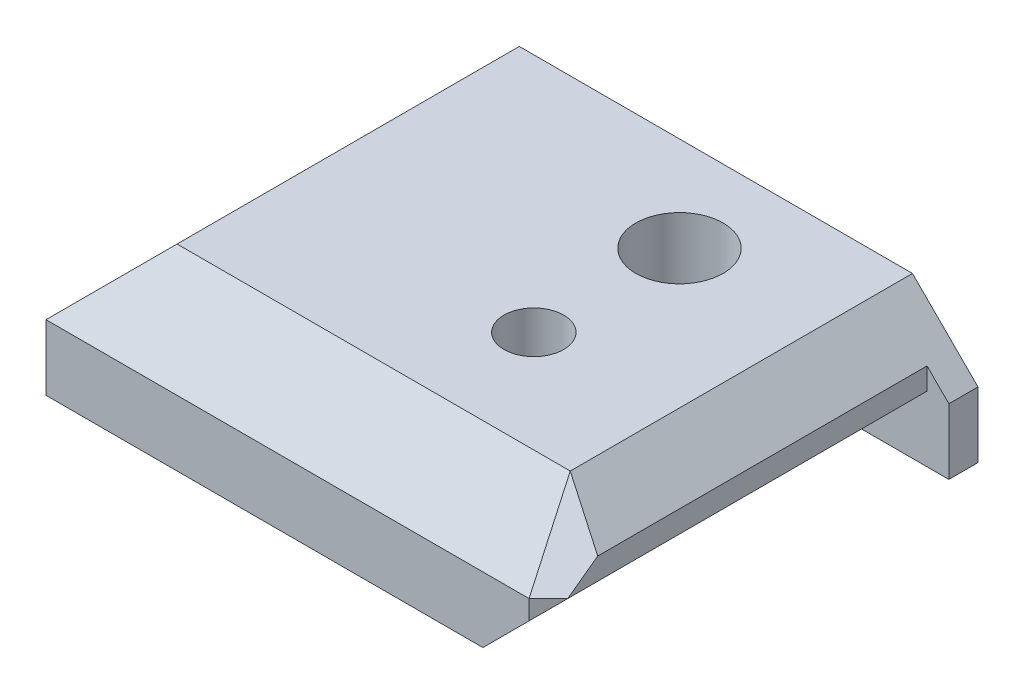
ISO-10303-21;
HEADER;
FILE_DESCRIPTION(('STEP AP214'),'2;1');
FILE_NAME('part.step','',(''),(''),'','','');
FILE_SCHEMA(('AUTOMOTIVE_DESIGN { 1 0 10303 214 1 1 1 1 }'));
ENDSEC;
DATA;
#1=APPLICATION_CONTEXT('core data for automotive mechanical design processes');
#2=APPLICATION_PROTOCOL_DEFINITION('international standard','automotive_design',2000,#1);
#3=PRODUCT_CONTEXT('',#1,'mechanical');
#4=PRODUCT('Part','Part','',(#3));
#5=PRODUCT_RELATED_PRODUCT_CATEGORY('part','',(#4));
#6=PRODUCT_DEFINITION_FORMATION('','',#4);
#7=PRODUCT_DEFINITION_CONTEXT('part definition',#1,'design');
#8=PRODUCT_DEFINITION('design','',#6,#7);
#9=PRODUCT_DEFINITION_SHAPE('','',#8);
#10=(LENGTH_UNIT() NAMED_UNIT(*) SI_UNIT(.MILLI.,.METRE.));
#11=(NAMED_UNIT(*) PLANE_ANGLE_UNIT() SI_UNIT($,.RADIAN.));
#12=(NAMED_UNIT(*) SI_UNIT($,.STERADIAN.) SOLID_ANGLE_UNIT());
#13=UNCERTAINTY_MEASURE_WITH_UNIT(LENGTH_MEASURE(1.E-05),#10,'distance_accuracy_value','');
#14=(GEOMETRIC_REPRESENTATION_CONTEXT(3) GLOBAL_UNCERTAINTY_ASSIGNED_CONTEXT((#13)) GLOBAL_UNIT_ASSIGNED_CONTEXT((#10,
#11,#12)) REPRESENTATION_CONTEXT('',''));
#15=CARTESIAN_POINT('',(0.,0.,0.));
#16=DIRECTION('',(0.,0.,1.));
#17=DIRECTION('',(1.,0.,0.));
#18=AXIS2_PLACEMENT_3D('',#15,#16,#17);
#19=CARTESIAN_POINT('',(22.,13.2426406871193,16.5));
#20=DIRECTION('',(0.,-1.,0.));
#21=DIRECTION('',(0.,0.,-1.));
#22=AXIS2_PLACEMENT_3D('',#19,#20,#21);
#23=CYLINDRICAL_SURFACE('',#22,1.5);
#24=CARTESIAN_POINT('',(22.,0.,16.5));
#25=DIRECTION('',(0.,1.,0.));
#26=DIRECTION('',(0.,0.,1.));
#27=AXIS2_PLACEMENT_3D('',#24,#25,#26);
#28=CIRCLE('',#27,1.5);
#29=CARTESIAN_POINT('',(22.,0.,18.));
#30=VERTEX_POINT('',#29);
#31=EDGE_CURVE('E332',#30,#30,#28,.T.);
#32=ORIENTED_EDGE('',*,*,#31,.F.);
#33=EDGE_LOOP('',(#32));
#34=FACE_BOUND('',#33,.T.);
#35=CARTESIAN_POINT('',(22.,2.,16.5));
#36=DIRECTION('',(0.,1.,0.));
#37=DIRECTION('',(0.,0.,1.));
#38=AXIS2_PLACEMENT_3D('',#35,#36,#37);
#39=CIRCLE('',#38,1.5);
#40=CARTESIAN_POINT('',(22.,2.,18.));
#41=VERTEX_POINT('',#40);
#42=EDGE_CURVE('E45',#41,#41,#39,.T.);
#43=ORIENTED_EDGE('',*,*,#42,.T.);
#44=EDGE_LOOP('',(#43));
#45=FACE_BOUND('',#44,.T.);
#46=ADVANCED_FACE('F41',(#34,#45),#23,.F.);
#47=CARTESIAN_POINT('',(36.,0.,28.));
#48=DIRECTION('',(0.,1.,0.));
#49=DIRECTION('',(0.,0.,1.));
#50=AXIS2_PLACEMENT_3D('',#47,#48,#49);
#51=PLANE('',#50);
#52=ORIENTED_EDGE('',*,*,#31,.T.);
#53=EDGE_LOOP('',(#52));
#54=FACE_BOUND('',#53,.T.);
#55=CARTESIAN_POINT('',(22.,0.,6.5));
#56=DIRECTION('',(0.,1.,0.));
#57=DIRECTION('',(0.,0.,1.));
#58=AXIS2_PLACEMENT_3D('',#55,#56,#57);
#59=CIRCLE('',#58,1.5);
#60=CARTESIAN_POINT('',(22.,0.,8.));
#61=VERTEX_POINT('',#60);
#62=EDGE_CURVE('E324',#61,#61,#59,.F.);
#63=ORIENTED_EDGE('',*,*,#62,.F.);
#64=EDGE_LOOP('',(#63));
#65=FACE_BOUND('',#64,.T.);
#66=DIRECTION('',(1.,0.,0.));
#67=VECTOR('',#66,1.);
#68=CARTESIAN_POINT('',(36.,0.,2.));
#69=LINE('',#68,#67);
#70=CARTESIAN_POINT('',(30.,0.,2.));
#71=VERTEX_POINT('',#70);
#72=CARTESIAN_POINT('',(36.,0.,2.));
#73=VERTEX_POINT('',#72);
#74=EDGE_CURVE('E178',#71,#73,#69,.T.);
#75=ORIENTED_EDGE('',*,*,#74,.F.);
#76=DIRECTION('',(0.,0.,1.));
#77=VECTOR('',#76,1.);
#78=CARTESIAN_POINT('',(30.,0.,2.));
#79=LINE('',#78,#77);
#80=CARTESIAN_POINT('',(30.,0.,28.));
#81=VERTEX_POINT('',#80);
#82=EDGE_CURVE('E166',#71,#81,#79,.T.);
#83=ORIENTED_EDGE('',*,*,#82,.T.);
#84=DIRECTION('',(1.,0.,0.));
#85=VECTOR('',#84,1.);
#86=CARTESIAN_POINT('',(36.,0.,28.));
#87=LINE('',#86,#85);
#88=CARTESIAN_POINT('',(0.,0.,28.));
#89=VERTEX_POINT('',#88);
#90=EDGE_CURVE('E254',#89,#81,#87,.T.);
#91=ORIENTED_EDGE('',*,*,#90,.F.);
#92=DIRECTION('',(0.,0.,-1.));
#93=VECTOR('',#92,1.);
#94=CARTESIAN_POINT('',(0.,0.,28.));
#95=LINE('',#94,#93);
#96=CARTESIAN_POINT('',(0.,0.,0.));
#97=VERTEX_POINT('',#96);
#98=EDGE_CURVE('E260',#89,#97,#95,.T.);
#99=ORIENTED_EDGE('',*,*,#98,.T.);
#100=DIRECTION('',(1.,0.,0.));
#101=VECTOR('',#100,1.);
#102=CARTESIAN_POINT('',(36.,0.,0.));
#103=LINE('',#102,#101);
#104=CARTESIAN_POINT('',(5.,0.,0.));
#105=VERTEX_POINT('',#104);
#106=EDGE_CURVE('E261',#97,#105,#103,.T.);
#107=ORIENTED_EDGE('',*,*,#106,.T.);
#108=DIRECTION('',(0.,0.,-1.));
#109=VECTOR('',#108,1.);
#110=CARTESIAN_POINT('',(5.,0.,26.));
#111=LINE('',#110,#109);
#112=CARTESIAN_POINT('',(5.,0.,26.));
#113=VERTEX_POINT('',#112);
#114=EDGE_CURVE('E65',#113,#105,#111,.T.);
#115=ORIENTED_EDGE('',*,*,#114,.F.);
#116=DIRECTION('',(1.,0.,0.));
#117=VECTOR('',#116,1.);
#118=CARTESIAN_POINT('',(5.,0.,26.));
#119=LINE('',#118,#117);
#120=CARTESIAN_POINT('',(13.8116308862596,0.,26.));
#121=VERTEX_POINT('',#120);
#122=EDGE_CURVE('E186',#113,#121,#119,.T.);
#123=ORIENTED_EDGE('',*,*,#122,.T.);
#124=DIRECTION('',(0.,0.,-1.));
#125=VECTOR('',#124,1.);
#126=CARTESIAN_POINT('',(13.8116308862596,0.,26.));
#127=LINE('',#126,#125);
#128=CARTESIAN_POINT('',(13.8116308862596,0.,0.));
#129=VERTEX_POINT('',#128);
#130=EDGE_CURVE('E221',#121,#129,#127,.T.);
#131=ORIENTED_EDGE('',*,*,#130,.T.);
#132=CARTESIAN_POINT('',(36.,0.,0.));
#133=VERTEX_POINT('',#132);
#134=EDGE_CURVE('E248',#129,#133,#103,.T.);
#135=ORIENTED_EDGE('',*,*,#134,.T.);
#136=DIRECTION('',(0.,0.,-1.));
#137=VECTOR('',#136,1.);
#138=CARTESIAN_POINT('',(36.,0.,28.));
#139=LINE('',#138,#137);
#140=EDGE_CURVE('E273',#73,#133,#139,.T.);
#141=ORIENTED_EDGE('',*,*,#140,.F.);
#142=EDGE_LOOP('',(#75,#83,#91,#99,#107,#115,#123,#131,#135,#141));
#143=FACE_BOUND('',#142,.T.);
#144=ADVANCED_FACE('F43',(#54,#65,#143),#51,.F.);
#145=CARTESIAN_POINT('',(0.,0.,0.));
#146=DIRECTION('',(0.,0.,-1.));
#147=DIRECTION('',(-1.,0.,0.));
#148=AXIS2_PLACEMENT_3D('',#145,#146,#147);
#149=PLANE('',#148);
#150=ORIENTED_EDGE('',*,*,#134,.F.);
#151=DIRECTION('',(0.,1.,0.));
#152=VECTOR('',#151,1.);
#153=CARTESIAN_POINT('',(13.8116308862596,0.,0.));
#154=LINE('',#153,#152);
#155=CARTESIAN_POINT('',(13.8116308862596,3.,0.));
#156=VERTEX_POINT('',#155);
#157=EDGE_CURVE('E185',#129,#156,#154,.T.);
#158=ORIENTED_EDGE('',*,*,#157,.T.);
#159=DIRECTION('',(-0.707106781186551,0.707106781186544,0.));
#160=VECTOR('',#159,1.);
#161=CARTESIAN_POINT('',(13.8116308862596,3.,0.));
#162=LINE('',#161,#160);
#163=CARTESIAN_POINT('',(13.104524105073,3.70710678118655,0.));
#164=VERTEX_POINT('',#163);
#165=EDGE_CURVE('E202',#156,#164,#162,.T.);
#166=ORIENTED_EDGE('',*,*,#165,.T.);
#167=DIRECTION('',(-1.,0.,0.));
#168=VECTOR('',#167,1.);
#169=CARTESIAN_POINT('',(5.70710678118655,3.70710678118655,0.));
#170=LINE('',#169,#168);
#171=CARTESIAN_POINT('',(5.70710678118655,3.70710678118655,0.));
#172=VERTEX_POINT('',#171);
#173=EDGE_CURVE('E205',#164,#172,#170,.T.);
#174=ORIENTED_EDGE('',*,*,#173,.T.);
#175=DIRECTION('',(-0.707106781186547,-0.707106781186547,0.));
#176=VECTOR('',#175,1.);
#177=CARTESIAN_POINT('',(5.,3.,0.));
#178=LINE('',#177,#176);
#179=CARTESIAN_POINT('',(5.,3.,0.));
#180=VERTEX_POINT('',#179);
#181=EDGE_CURVE('E208',#172,#180,#178,.T.);
#182=ORIENTED_EDGE('',*,*,#181,.T.);
#183=DIRECTION('',(0.,-1.,0.));
#184=VECTOR('',#183,1.);
#185=CARTESIAN_POINT('',(5.,0.,0.));
#186=LINE('',#185,#184);
#187=EDGE_CURVE('E190',#180,#105,#186,.T.);
#188=ORIENTED_EDGE('',*,*,#187,.T.);
#189=ORIENTED_EDGE('',*,*,#106,.F.);
#190=DIRECTION('',(0.,-1.,0.));
#191=VECTOR('',#190,1.);
#192=CARTESIAN_POINT('',(0.,0.,0.));
#193=LINE('',#192,#191);
#194=CARTESIAN_POINT('',(0.,4.5,0.));
#195=VERTEX_POINT('',#194);
#196=EDGE_CURVE('E258',#195,#97,#193,.T.);
#197=ORIENTED_EDGE('',*,*,#196,.F.);
#198=DIRECTION('',(0.707106781186546,0.707106781186549,0.));
#199=VECTOR('',#198,1.);
#200=CARTESIAN_POINT('',(0.,4.5,0.));
#201=LINE('',#200,#199);
#202=CARTESIAN_POINT('',(4.49999999999998,9.,0.));
#203=VERTEX_POINT('',#202);
#204=EDGE_CURVE('E239',#195,#203,#201,.T.);
#205=ORIENTED_EDGE('',*,*,#204,.T.);
#206=DIRECTION('',(-1.,0.,0.));
#207=VECTOR('',#206,1.);
#208=CARTESIAN_POINT('',(0.,9.,0.));
#209=LINE('',#208,#207);
#210=CARTESIAN_POINT('',(31.5,9.,0.));
#211=VERTEX_POINT('',#210);
#212=EDGE_CURVE('E267',#211,#203,#209,.T.);
#213=ORIENTED_EDGE('',*,*,#212,.F.);
#214=DIRECTION('',(0.707106781186546,-0.707106781186549,0.));
#215=VECTOR('',#214,1.);
#216=CARTESIAN_POINT('',(36.,4.5,0.));
#217=LINE('',#216,#215);
#218=CARTESIAN_POINT('',(36.,4.50000000000001,0.));
#219=VERTEX_POINT('',#218);
#220=EDGE_CURVE('E243',#211,#219,#217,.T.);
#221=ORIENTED_EDGE('',*,*,#220,.T.);
#222=DIRECTION('',(0.,1.,0.));
#223=VECTOR('',#222,1.);
#224=CARTESIAN_POINT('',(36.,9.,0.));
#225=LINE('',#224,#223);
#226=EDGE_CURVE('E264',#133,#219,#225,.T.);
#227=ORIENTED_EDGE('',*,*,#226,.F.);
#228=EDGE_LOOP('',(#150,#158,#166,#174,#182,#188,#189,#197,#205,#213,#221,#227));
#229=FACE_BOUND('',#228,.T.);
#230=ADVANCED_FACE('F300',(#229),#149,.T.);
#231=CARTESIAN_POINT('',(36.,4.5,28.));
#232=DIRECTION('',(0.707106781186549,0.707106781186547,0.));
#233=DIRECTION('',(-0.707106781186546,0.707106781186549,0.));
#234=AXIS2_PLACEMENT_3D('',#231,#232,#233);
#235=PLANE('',#234);
#236=DIRECTION('',(0.,0.,1.));
#237=VECTOR('',#236,1.);
#238=CARTESIAN_POINT('',(34.5,5.99999999999998,2.));
#239=LINE('',#238,#237);
#240=CARTESIAN_POINT('',(34.5,5.99999999999998,2.));
#241=VERTEX_POINT('',#240);
#242=CARTESIAN_POINT('',(34.5,5.99999999999998,24.6143819168359));
#243=VERTEX_POINT('',#242);
#244=EDGE_CURVE('E57',#241,#243,#239,.T.);
#245=ORIENTED_EDGE('',*,*,#244,.F.);
#246=DIRECTION('',(-0.707106781186546,0.707106781186549,0.));
#247=VECTOR('',#246,1.);
#248=CARTESIAN_POINT('',(36.,4.5,2.));
#249=LINE('',#248,#247);
#250=CARTESIAN_POINT('',(36.,4.50000000000001,2.));
#251=VERTEX_POINT('',#250);
#252=EDGE_CURVE('E157',#251,#241,#249,.T.);
#253=ORIENTED_EDGE('',*,*,#252,.F.);
#254=DIRECTION('',(0.,0.,-1.));
#255=VECTOR('',#254,1.);
#256=CARTESIAN_POINT('',(36.,4.5,28.));
#257=LINE('',#256,#255);
#258=EDGE_CURVE('E250',#251,#219,#257,.T.);
#259=ORIENTED_EDGE('',*,*,#258,.T.);
#260=ORIENTED_EDGE('',*,*,#220,.F.);
#261=DIRECTION('',(0.,0.,-1.));
#262=VECTOR('',#261,1.);
#263=CARTESIAN_POINT('',(31.5,9.,28.));
#264=LINE('',#263,#262);
#265=CARTESIAN_POINT('',(31.5,9.,23.5));
#266=VERTEX_POINT('',#265);
#267=EDGE_CURVE('E238',#266,#211,#264,.T.);
#268=ORIENTED_EDGE('',*,*,#267,.F.);
#269=DIRECTION('',(0.683908301776168,-0.68390830177617,0.254045014757763));
#270=VECTOR('',#269,1.);
#271=CARTESIAN_POINT('',(36.4914208129248,4.00857918707516,25.3541163644139));
#272=LINE('',#271,#270);
#273=EDGE_CURVE('E177',#266,#243,#272,.T.);
#274=ORIENTED_EDGE('',*,*,#273,.T.);
#275=EDGE_LOOP('',(#245,#253,#259,#260,#268,#274));
#276=FACE_BOUND('',#275,.T.);
#277=ADVANCED_FACE('F175',(#276),#235,.T.);
#278=CARTESIAN_POINT('',(36.,4.5,28.));
#279=DIRECTION('',(0.,0.707106781186546,0.707106781186549));
#280=DIRECTION('',(0.,-0.707106781186549,0.707106781186546));
#281=AXIS2_PLACEMENT_3D('',#278,#279,#280);
#282=PLANE('',#281);
#283=DIRECTION('',(-1.,0.,0.));
#284=VECTOR('',#283,1.);
#285=CARTESIAN_POINT('',(36.,4.5,28.));
#286=LINE('',#285,#284);
#287=CARTESIAN_POINT('',(33.1715728752538,4.5,28.));
#288=VERTEX_POINT('',#287);
#289=CARTESIAN_POINT('',(0.,4.5,28.));
#290=VERTEX_POINT('',#289);
#291=EDGE_CURVE('E236',#288,#290,#286,.T.);
#292=ORIENTED_EDGE('',*,*,#291,.F.);
#293=DIRECTION('',(-0.254045014757767,0.68390830177617,-0.683908301776167));
#294=VECTOR('',#293,1.);
#295=CARTESIAN_POINT('',(33.3541163644139,4.00857918707515,28.4914208129248));
#296=LINE('',#295,#294);
#297=EDGE_CURVE('E227',#288,#266,#296,.T.);
#298=ORIENTED_EDGE('',*,*,#297,.T.);
#299=DIRECTION('',(-1.,0.,0.));
#300=VECTOR('',#299,1.);
#301=CARTESIAN_POINT('',(36.,9.,23.5));
#302=LINE('',#301,#300);
#303=CARTESIAN_POINT('',(4.49999999999998,9.,23.5));
#304=VERTEX_POINT('',#303);
#305=EDGE_CURVE('E234',#266,#304,#302,.T.);
#306=ORIENTED_EDGE('',*,*,#305,.T.);
#307=DIRECTION('',(0.577350269189625,0.577350269189627,-0.577350269189625));
#308=VECTOR('',#307,1.);
#309=CARTESIAN_POINT('',(0.,4.5,28.));
#310=LINE('',#309,#308);
#311=EDGE_CURVE('E275',#290,#304,#310,.T.);
#312=ORIENTED_EDGE('',*,*,#311,.F.);
#313=EDGE_LOOP('',(#292,#298,#306,#312));
#314=FACE_BOUND('',#313,.T.);
#315=ADVANCED_FACE('F290',(#314),#282,.T.);
#316=CARTESIAN_POINT('',(30.585786437627,0.,30.5857864376269));
#317=DIRECTION('',(0.707106781186549,0.,0.707106781186546));
#318=DIRECTION('',(0.707106781186546,0.,-0.707106781186549));
#319=AXIS2_PLACEMENT_3D('',#316,#317,#318);
#320=PLANE('',#319);
#321=DIRECTION('',(-0.577350269189626,-0.577350269189623,0.577350269189628));
#322=VECTOR('',#321,1.);
#323=CARTESIAN_POINT('',(30.3905242917513,0.390524291751312,30.7810485835025));
#324=LINE('',#323,#322);
#325=CARTESIAN_POINT('',(34.5,4.5,26.6715728752538));
#326=VERTEX_POINT('',#325);
#327=CARTESIAN_POINT('',(33.1715728752538,3.17157287525381,28.));
#328=VERTEX_POINT('',#327);
#329=EDGE_CURVE('E165',#326,#328,#324,.T.);
#330=ORIENTED_EDGE('',*,*,#329,.F.);
#331=DIRECTION('',(0.707106781186546,0.,-0.707106781186549));
#332=VECTOR('',#331,1.);
#333=CARTESIAN_POINT('',(33.1715728752538,4.5,28.));
#334=LINE('',#333,#332);
#335=EDGE_CURVE('E224',#288,#326,#334,.T.);
#336=ORIENTED_EDGE('',*,*,#335,.F.);
#337=DIRECTION('',(0.,-1.,0.));
#338=VECTOR('',#337,1.);
#339=CARTESIAN_POINT('',(33.1715728752538,0.,28.));
#340=LINE('',#339,#338);
#341=EDGE_CURVE('E231',#288,#328,#340,.T.);
#342=ORIENTED_EDGE('',*,*,#341,.T.);
#343=EDGE_LOOP('',(#330,#336,#342));
#344=FACE_BOUND('',#343,.T.);
#345=ADVANCED_FACE('F284',(#344),#320,.T.);
#346=CARTESIAN_POINT('',(0.,0.,28.));
#347=DIRECTION('',(0.,0.,-1.));
#348=DIRECTION('',(-1.,0.,0.));
#349=AXIS2_PLACEMENT_3D('',#346,#347,#348);
#350=PLANE('',#349);
#351=ORIENTED_EDGE('',*,*,#90,.T.);
#352=DIRECTION('',(0.70710678118655,0.707106781186545,0.));
#353=VECTOR('',#352,1.);
#354=CARTESIAN_POINT('',(14.9999999999999,-15.,28.));
#355=LINE('',#354,#353);
#356=EDGE_CURVE('E11',#81,#328,#355,.T.);
#357=ORIENTED_EDGE('',*,*,#356,.T.);
#358=ORIENTED_EDGE('',*,*,#341,.F.);
#359=ORIENTED_EDGE('',*,*,#291,.T.);
#360=DIRECTION('',(0.,-1.,0.));
#361=VECTOR('',#360,1.);
#362=CARTESIAN_POINT('',(0.,0.,28.));
#363=LINE('',#362,#361);
#364=EDGE_CURVE('E257',#290,#89,#363,.T.);
#365=ORIENTED_EDGE('',*,*,#364,.T.);
#366=EDGE_LOOP('',(#351,#357,#358,#359,#365));
#367=FACE_BOUND('',#366,.T.);
#368=ADVANCED_FACE('F312',(#367),#350,.F.);
#369=CARTESIAN_POINT('',(36.,9.,28.));
#370=DIRECTION('',(-1.,0.,0.));
#371=DIRECTION('',(0.,0.,1.));
#372=AXIS2_PLACEMENT_3D('',#369,#370,#371);
#373=PLANE('',#372);
#374=ORIENTED_EDGE('',*,*,#258,.F.);
#375=DIRECTION('',(0.,1.,0.));
#376=VECTOR('',#375,1.);
#377=CARTESIAN_POINT('',(36.,5.99999999999998,2.));
#378=LINE('',#377,#376);
#379=EDGE_CURVE('E162',#73,#251,#378,.T.);
#380=ORIENTED_EDGE('',*,*,#379,.F.);
#381=ORIENTED_EDGE('',*,*,#140,.T.);
#382=ORIENTED_EDGE('',*,*,#226,.T.);
#383=EDGE_LOOP('',(#374,#380,#381,#382));
#384=FACE_BOUND('',#383,.T.);
#385=ADVANCED_FACE('F418',(#384),#373,.F.);
#386=CARTESIAN_POINT('',(0.,9.,28.));
#387=DIRECTION('',(0.,-1.,0.));
#388=DIRECTION('',(0.,0.,-1.));
#389=AXIS2_PLACEMENT_3D('',#386,#387,#388);
#390=PLANE('',#389);
#391=CARTESIAN_POINT('',(22.,9.,16.5));
#392=DIRECTION('',(0.,1.,0.));
#393=DIRECTION('',(0.,0.,1.));
#394=AXIS2_PLACEMENT_3D('',#391,#392,#393);
#395=CIRCLE('',#394,2.05);
#396=CARTESIAN_POINT('',(22.,9.,18.55));
#397=VERTEX_POINT('',#396);
#398=EDGE_CURVE('E335',#397,#397,#395,.T.);
#399=ORIENTED_EDGE('',*,*,#398,.F.);
#400=EDGE_LOOP('',(#399));
#401=FACE_BOUND('',#400,.T.);
#402=CARTESIAN_POINT('',(22.,9.,6.5));
#403=DIRECTION('',(0.,1.,0.));
#404=DIRECTION('',(0.,0.,1.));
#405=AXIS2_PLACEMENT_3D('',#402,#403,#404);
#406=CIRCLE('',#405,3.);
#407=CARTESIAN_POINT('',(22.,9.,9.5));
#408=VERTEX_POINT('',#407);
#409=EDGE_CURVE('E321',#408,#408,#406,.T.);
#410=ORIENTED_EDGE('',*,*,#409,.F.);
#411=EDGE_LOOP('',(#410));
#412=FACE_BOUND('',#411,.T.);
#413=ORIENTED_EDGE('',*,*,#305,.F.);
#414=ORIENTED_EDGE('',*,*,#267,.T.);
#415=ORIENTED_EDGE('',*,*,#212,.T.);
#416=DIRECTION('',(0.,0.,-1.));
#417=VECTOR('',#416,1.);
#418=CARTESIAN_POINT('',(4.49999999999998,9.,28.));
#419=LINE('',#418,#417);
#420=EDGE_CURVE('E242',#304,#203,#419,.T.);
#421=ORIENTED_EDGE('',*,*,#420,.F.);
#422=EDGE_LOOP('',(#413,#414,#415,#421));
#423=FACE_BOUND('',#422,.T.);
#424=ADVANCED_FACE('F294',(#401,#412,#423),#390,.F.);
#425=CARTESIAN_POINT('',(0.,4.5,28.));
#426=DIRECTION('',(-0.707106781186549,0.707106781186546,0.));
#427=DIRECTION('',(-0.707106781186546,-0.707106781186549,0.));
#428=AXIS2_PLACEMENT_3D('',#425,#426,#427);
#429=PLANE('',#428);
#430=DIRECTION('',(0.,0.,-1.));
#431=VECTOR('',#430,1.);
#432=CARTESIAN_POINT('',(0.,4.5,28.));
#433=LINE('',#432,#431);
#434=EDGE_CURVE('E245',#290,#195,#433,.T.);
#435=ORIENTED_EDGE('',*,*,#434,.F.);
#436=ORIENTED_EDGE('',*,*,#311,.T.);
#437=ORIENTED_EDGE('',*,*,#420,.T.);
#438=ORIENTED_EDGE('',*,*,#204,.F.);
#439=EDGE_LOOP('',(#435,#436,#437,#438));
#440=FACE_BOUND('',#439,.T.);
#441=ADVANCED_FACE('F305',(#440),#429,.T.);
#442=CARTESIAN_POINT('',(0.,0.,28.));
#443=DIRECTION('',(1.,0.,0.));
#444=DIRECTION('',(0.,0.,-1.));
#445=AXIS2_PLACEMENT_3D('',#442,#443,#444);
#446=PLANE('',#445);
#447=ORIENTED_EDGE('',*,*,#434,.T.);
#448=ORIENTED_EDGE('',*,*,#196,.T.);
#449=ORIENTED_EDGE('',*,*,#98,.F.);
#450=ORIENTED_EDGE('',*,*,#364,.F.);
#451=EDGE_LOOP('',(#447,#448,#449,#450));
#452=FACE_BOUND('',#451,.T.);
#453=ADVANCED_FACE('F308',(#452),#446,.F.);
#454=CARTESIAN_POINT('',(30.0857864376269,9.00000000000001,24.9142135623731));
#455=DIRECTION('',(0.507613933017222,0.696172528913327,0.507613933017219));
#456=DIRECTION('',(-0.808014088376717,0.589163163295826,0.));
#457=AXIS2_PLACEMENT_3D('',#454,#455,#456);
#458=PLANE('',#457);
#459=DIRECTION('',(0.,-0.589163163295823,0.808014088376719));
#460=VECTOR('',#459,1.);
#461=CARTESIAN_POINT('',(34.5,6.89860420356718,23.3819816216527));
#462=LINE('',#461,#460);
#463=EDGE_CURVE('E50',#243,#326,#462,.T.);
#464=ORIENTED_EDGE('',*,*,#463,.F.);
#465=ORIENTED_EDGE('',*,*,#273,.F.);
#466=ORIENTED_EDGE('',*,*,#297,.F.);
#467=ORIENTED_EDGE('',*,*,#335,.T.);
#468=EDGE_LOOP('',(#464,#465,#466,#467));
#469=FACE_BOUND('',#468,.T.);
#470=ADVANCED_FACE('F286',(#469),#458,.T.);
#471=CARTESIAN_POINT('',(13.8116308862596,0.,26.));
#472=DIRECTION('',(-1.,0.,0.));
#473=DIRECTION('',(0.,0.,1.));
#474=AXIS2_PLACEMENT_3D('',#471,#472,#473);
#475=PLANE('',#474);
#476=ORIENTED_EDGE('',*,*,#157,.F.);
#477=ORIENTED_EDGE('',*,*,#130,.F.);
#478=DIRECTION('',(0.,1.,0.));
#479=VECTOR('',#478,1.);
#480=CARTESIAN_POINT('',(13.8116308862596,0.,26.));
#481=LINE('',#480,#479);
#482=CARTESIAN_POINT('',(13.8116308862596,3.,26.));
#483=VERTEX_POINT('',#482);
#484=EDGE_CURVE('E189',#121,#483,#481,.T.);
#485=ORIENTED_EDGE('',*,*,#484,.T.);
#486=DIRECTION('',(0.,0.,-1.));
#487=VECTOR('',#486,1.);
#488=CARTESIAN_POINT('',(13.8116308862596,3.,26.));
#489=LINE('',#488,#487);
#490=EDGE_CURVE('E219',#483,#156,#489,.T.);
#491=ORIENTED_EDGE('',*,*,#490,.T.);
#492=EDGE_LOOP('',(#476,#477,#485,#491));
#493=FACE_BOUND('',#492,.T.);
#494=ADVANCED_FACE('F401',(#493),#475,.T.);
#495=CARTESIAN_POINT('',(13.8116308862596,3.,26.));
#496=DIRECTION('',(-0.707106781186544,-0.707106781186551,0.));
#497=DIRECTION('',(0.707106781186551,-0.707106781186544,0.));
#498=AXIS2_PLACEMENT_3D('',#495,#496,#497);
#499=PLANE('',#498);
#500=ORIENTED_EDGE('',*,*,#165,.F.);
#501=ORIENTED_EDGE('',*,*,#490,.F.);
#502=DIRECTION('',(-0.707106781186551,0.707106781186544,0.));
#503=VECTOR('',#502,1.);
#504=CARTESIAN_POINT('',(13.8116308862596,3.,26.));
#505=LINE('',#504,#503);
#506=CARTESIAN_POINT('',(13.104524105073,3.70710678118655,26.));
#507=VERTEX_POINT('',#506);
#508=EDGE_CURVE('E192',#483,#507,#505,.T.);
#509=ORIENTED_EDGE('',*,*,#508,.T.);
#510=DIRECTION('',(0.,0.,-1.));
#511=VECTOR('',#510,1.);
#512=CARTESIAN_POINT('',(13.104524105073,3.70710678118655,26.));
#513=LINE('',#512,#511);
#514=EDGE_CURVE('E217',#507,#164,#513,.T.);
#515=ORIENTED_EDGE('',*,*,#514,.T.);
#516=EDGE_LOOP('',(#500,#501,#509,#515));
#517=FACE_BOUND('',#516,.T.);
#518=ADVANCED_FACE('F397',(#517),#499,.T.);
#519=CARTESIAN_POINT('',(5.70710678118655,3.70710678118655,26.));
#520=DIRECTION('',(0.,-1.,0.));
#521=DIRECTION('',(0.,0.,-1.));
#522=AXIS2_PLACEMENT_3D('',#519,#520,#521);
#523=PLANE('',#522);
#524=ORIENTED_EDGE('',*,*,#173,.F.);
#525=ORIENTED_EDGE('',*,*,#514,.F.);
#526=DIRECTION('',(-1.,0.,0.));
#527=VECTOR('',#526,1.);
#528=CARTESIAN_POINT('',(5.70710678118655,3.70710678118655,26.));
#529=LINE('',#528,#527);
#530=CARTESIAN_POINT('',(5.70710678118655,3.70710678118655,26.));
#531=VERTEX_POINT('',#530);
#532=EDGE_CURVE('E194',#507,#531,#529,.T.);
#533=ORIENTED_EDGE('',*,*,#532,.T.);
#534=DIRECTION('',(0.,0.,-1.));
#535=VECTOR('',#534,1.);
#536=CARTESIAN_POINT('',(5.70710678118655,3.70710678118655,26.));
#537=LINE('',#536,#535);
#538=EDGE_CURVE('E215',#531,#172,#537,.T.);
#539=ORIENTED_EDGE('',*,*,#538,.T.);
#540=EDGE_LOOP('',(#524,#525,#533,#539));
#541=FACE_BOUND('',#540,.T.);
#542=ADVANCED_FACE('F393',(#541),#523,.T.);
#543=CARTESIAN_POINT('',(5.,3.,26.));
#544=DIRECTION('',(0.707106781186548,-0.707106781186548,0.));
#545=DIRECTION('',(0.707106781186548,0.707106781186548,0.));
#546=AXIS2_PLACEMENT_3D('',#543,#544,#545);
#547=PLANE('',#546);
#548=ORIENTED_EDGE('',*,*,#181,.F.);
#549=ORIENTED_EDGE('',*,*,#538,.F.);
#550=DIRECTION('',(-0.707106781186547,-0.707106781186547,0.));
#551=VECTOR('',#550,1.);
#552=CARTESIAN_POINT('',(5.,3.,26.));
#553=LINE('',#552,#551);
#554=CARTESIAN_POINT('',(5.,3.,26.));
#555=VERTEX_POINT('',#554);
#556=EDGE_CURVE('E196',#531,#555,#553,.T.);
#557=ORIENTED_EDGE('',*,*,#556,.T.);
#558=DIRECTION('',(0.,0.,-1.));
#559=VECTOR('',#558,1.);
#560=CARTESIAN_POINT('',(5.,3.,26.));
#561=LINE('',#560,#559);
#562=EDGE_CURVE('E213',#555,#180,#561,.T.);
#563=ORIENTED_EDGE('',*,*,#562,.T.);
#564=EDGE_LOOP('',(#548,#549,#557,#563));
#565=FACE_BOUND('',#564,.T.);
#566=ADVANCED_FACE('F390',(#565),#547,.T.);
#567=CARTESIAN_POINT('',(5.,0.,26.));
#568=DIRECTION('',(1.,0.,0.));
#569=DIRECTION('',(0.,0.,-1.));
#570=AXIS2_PLACEMENT_3D('',#567,#568,#569);
#571=PLANE('',#570);
#572=ORIENTED_EDGE('',*,*,#187,.F.);
#573=ORIENTED_EDGE('',*,*,#562,.F.);
#574=DIRECTION('',(0.,-1.,0.));
#575=VECTOR('',#574,1.);
#576=CARTESIAN_POINT('',(5.,0.,26.));
#577=LINE('',#576,#575);
#578=EDGE_CURVE('E198',#555,#113,#577,.T.);
#579=ORIENTED_EDGE('',*,*,#578,.T.);
#580=ORIENTED_EDGE('',*,*,#114,.T.);
#581=EDGE_LOOP('',(#572,#573,#579,#580));
#582=FACE_BOUND('',#581,.T.);
#583=ADVANCED_FACE('F386',(#582),#571,.T.);
#584=CARTESIAN_POINT('',(0.,0.,26.));
#585=DIRECTION('',(0.,0.,1.));
#586=DIRECTION('',(1.,0.,0.));
#587=AXIS2_PLACEMENT_3D('',#584,#585,#586);
#588=PLANE('',#587);
#589=ORIENTED_EDGE('',*,*,#122,.F.);
#590=ORIENTED_EDGE('',*,*,#578,.F.);
#591=ORIENTED_EDGE('',*,*,#556,.F.);
#592=ORIENTED_EDGE('',*,*,#532,.F.);
#593=ORIENTED_EDGE('',*,*,#508,.F.);
#594=ORIENTED_EDGE('',*,*,#484,.F.);
#595=EDGE_LOOP('',(#589,#590,#591,#592,#593,#594));
#596=FACE_BOUND('',#595,.T.);
#597=ADVANCED_FACE('F381',(#596),#588,.F.);
#598=CARTESIAN_POINT('',(34.5,4.5,2.));
#599=DIRECTION('',(-0.707106781186545,0.70710678118655,0.));
#600=DIRECTION('',(-0.70710678118655,-0.707106781186545,0.));
#601=AXIS2_PLACEMENT_3D('',#598,#599,#600);
#602=PLANE('',#601);
#603=ORIENTED_EDGE('',*,*,#329,.T.);
#604=ORIENTED_EDGE('',*,*,#356,.F.);
#605=ORIENTED_EDGE('',*,*,#82,.F.);
#606=DIRECTION('',(-0.70710678118655,-0.707106781186545,0.));
#607=VECTOR('',#606,1.);
#608=CARTESIAN_POINT('',(34.5,4.5,2.));
#609=LINE('',#608,#607);
#610=CARTESIAN_POINT('',(34.5,4.5,2.));
#611=VERTEX_POINT('',#610);
#612=EDGE_CURVE('E172',#611,#71,#609,.T.);
#613=ORIENTED_EDGE('',*,*,#612,.F.);
#614=DIRECTION('',(0.,0.,1.));
#615=VECTOR('',#614,1.);
#616=CARTESIAN_POINT('',(34.5,4.5,2.));
#617=LINE('',#616,#615);
#618=EDGE_CURVE('E170',#611,#326,#617,.T.);
#619=ORIENTED_EDGE('',*,*,#618,.T.);
#620=EDGE_LOOP('',(#603,#604,#605,#613,#619));
#621=FACE_BOUND('',#620,.T.);
#622=ADVANCED_FACE('F281',(#621),#602,.F.);
#623=CARTESIAN_POINT('',(34.5,4.5,2.));
#624=DIRECTION('',(-1.,0.,0.));
#625=DIRECTION('',(0.,0.,1.));
#626=AXIS2_PLACEMENT_3D('',#623,#624,#625);
#627=PLANE('',#626);
#628=ORIENTED_EDGE('',*,*,#463,.T.);
#629=ORIENTED_EDGE('',*,*,#618,.F.);
#630=DIRECTION('',(0.,-1.,0.));
#631=VECTOR('',#630,1.);
#632=CARTESIAN_POINT('',(34.5,4.5,2.));
#633=LINE('',#632,#631);
#634=EDGE_CURVE('E160',#241,#611,#633,.T.);
#635=ORIENTED_EDGE('',*,*,#634,.F.);
#636=ORIENTED_EDGE('',*,*,#244,.T.);
#637=EDGE_LOOP('',(#628,#629,#635,#636));
#638=FACE_BOUND('',#637,.T.);
#639=ADVANCED_FACE('F168',(#638),#627,.F.);
#640=CARTESIAN_POINT('',(0.,0.,2.));
#641=DIRECTION('',(0.,0.,-1.));
#642=DIRECTION('',(-1.,0.,0.));
#643=AXIS2_PLACEMENT_3D('',#640,#641,#642);
#644=PLANE('',#643);
#645=ORIENTED_EDGE('',*,*,#252,.T.);
#646=ORIENTED_EDGE('',*,*,#634,.T.);
#647=ORIENTED_EDGE('',*,*,#612,.T.);
#648=ORIENTED_EDGE('',*,*,#74,.T.);
#649=ORIENTED_EDGE('',*,*,#379,.T.);
#650=EDGE_LOOP('',(#645,#646,#647,#648,#649));
#651=FACE_BOUND('',#650,.T.);
#652=ADVANCED_FACE('F158',(#651),#644,.F.);
#653=CARTESIAN_POINT('',(22.,2.,6.5));
#654=DIRECTION('',(0.,1.,0.));
#655=DIRECTION('',(0.,0.,1.));
#656=AXIS2_PLACEMENT_3D('',#653,#654,#655);
#657=CYLINDRICAL_SURFACE('',#656,3.);
#658=CARTESIAN_POINT('',(22.,2.,6.5));
#659=DIRECTION('',(0.,1.,0.));
#660=DIRECTION('',(0.,0.,1.));
#661=AXIS2_PLACEMENT_3D('',#658,#659,#660);
#662=CIRCLE('',#661,3.);
#663=CARTESIAN_POINT('',(22.,2.,9.5));
#664=VERTEX_POINT('',#663);
#665=EDGE_CURVE('E320',#664,#664,#662,.T.);
#666=ORIENTED_EDGE('',*,*,#665,.F.);
#667=EDGE_LOOP('',(#666));
#668=FACE_BOUND('',#667,.T.);
#669=ORIENTED_EDGE('',*,*,#409,.T.);
#670=EDGE_LOOP('',(#669));
#671=FACE_BOUND('',#670,.T.);
#672=ADVANCED_FACE('F372',(#668,#671),#657,.F.);
#673=CARTESIAN_POINT('',(22.,2.,6.5));
#674=DIRECTION('',(0.,1.,0.));
#675=DIRECTION('',(0.,0.,1.));
#676=AXIS2_PLACEMENT_3D('',#673,#674,#675);
#677=PLANE('',#676);
#678=CARTESIAN_POINT('',(22.,2.,6.5));
#679=DIRECTION('',(0.,1.,0.));
#680=DIRECTION('',(0.,0.,1.));
#681=AXIS2_PLACEMENT_3D('',#678,#679,#680);
#682=CIRCLE('',#681,1.5);
#683=CARTESIAN_POINT('',(22.,2.,8.));
#684=VERTEX_POINT('',#683);
#685=EDGE_CURVE('E329',#684,#684,#682,.T.);
#686=ORIENTED_EDGE('',*,*,#685,.F.);
#687=EDGE_LOOP('',(#686));
#688=FACE_BOUND('',#687,.T.);
#689=ORIENTED_EDGE('',*,*,#665,.T.);
#690=EDGE_LOOP('',(#689));
#691=FACE_BOUND('',#690,.T.);
#692=ADVANCED_FACE('F368',(#688,#691),#677,.T.);
#693=CARTESIAN_POINT('',(22.,-4.24264068711929,6.5));
#694=DIRECTION('',(0.,1.,0.));
#695=DIRECTION('',(0.,0.,1.));
#696=AXIS2_PLACEMENT_3D('',#693,#694,#695);
#697=CYLINDRICAL_SURFACE('',#696,1.5);
#698=ORIENTED_EDGE('',*,*,#62,.T.);
#699=EDGE_LOOP('',(#698));
#700=FACE_BOUND('',#699,.T.);
#701=ORIENTED_EDGE('',*,*,#685,.T.);
#702=EDGE_LOOP('',(#701));
#703=FACE_BOUND('',#702,.T.);
#704=ADVANCED_FACE('F353',(#700,#703),#697,.F.);
#705=CARTESIAN_POINT('',(22.,2.,16.5));
#706=DIRECTION('',(0.,1.,0.));
#707=DIRECTION('',(0.,0.,1.));
#708=AXIS2_PLACEMENT_3D('',#705,#706,#707);
#709=CYLINDRICAL_SURFACE('',#708,2.05);
#710=CARTESIAN_POINT('',(22.,2.,16.5));
#711=DIRECTION('',(0.,1.,0.));
#712=DIRECTION('',(0.,0.,1.));
#713=AXIS2_PLACEMENT_3D('',#710,#711,#712);
#714=CIRCLE('',#713,2.05);
#715=CARTESIAN_POINT('',(22.,2.,18.55));
#716=VERTEX_POINT('',#715);
#717=EDGE_CURVE('E338',#716,#716,#714,.T.);
#718=ORIENTED_EDGE('',*,*,#717,.F.);
#719=EDGE_LOOP('',(#718));
#720=FACE_BOUND('',#719,.T.);
#721=ORIENTED_EDGE('',*,*,#398,.T.);
#722=EDGE_LOOP('',(#721));
#723=FACE_BOUND('',#722,.T.);
#724=ADVANCED_FACE('F348',(#720,#723),#709,.F.);
#725=CARTESIAN_POINT('',(22.,2.,16.5));
#726=DIRECTION('',(0.,1.,0.));
#727=DIRECTION('',(0.,0.,1.));
#728=AXIS2_PLACEMENT_3D('',#725,#726,#727);
#729=PLANE('',#728);
#730=ORIENTED_EDGE('',*,*,#42,.F.);
#731=EDGE_LOOP('',(#730));
#732=FACE_BOUND('',#731,.T.);
#733=ORIENTED_EDGE('',*,*,#717,.T.);
#734=EDGE_LOOP('',(#733));
#735=FACE_BOUND('',#734,.T.);
#736=ADVANCED_FACE('F346',(#732,#735),#729,.T.);
#737=CLOSED_SHELL('',(#46,#144,#230,#277,#315,#345,#368,#385,#424,#441,#453,#470,#494,#518,#542,
#566,#583,#597,#622,#639,#652,#672,#692,#704,#724,#736));
#738=MANIFOLD_SOLID_BREP('B2',#737);
#739=ADVANCED_BREP_SHAPE_REPRESENTATION('',(#18,#738),#14);
#740=SHAPE_DEFINITION_REPRESENTATION(#9,#739);
ENDSEC;
END-ISO-10303-21;
